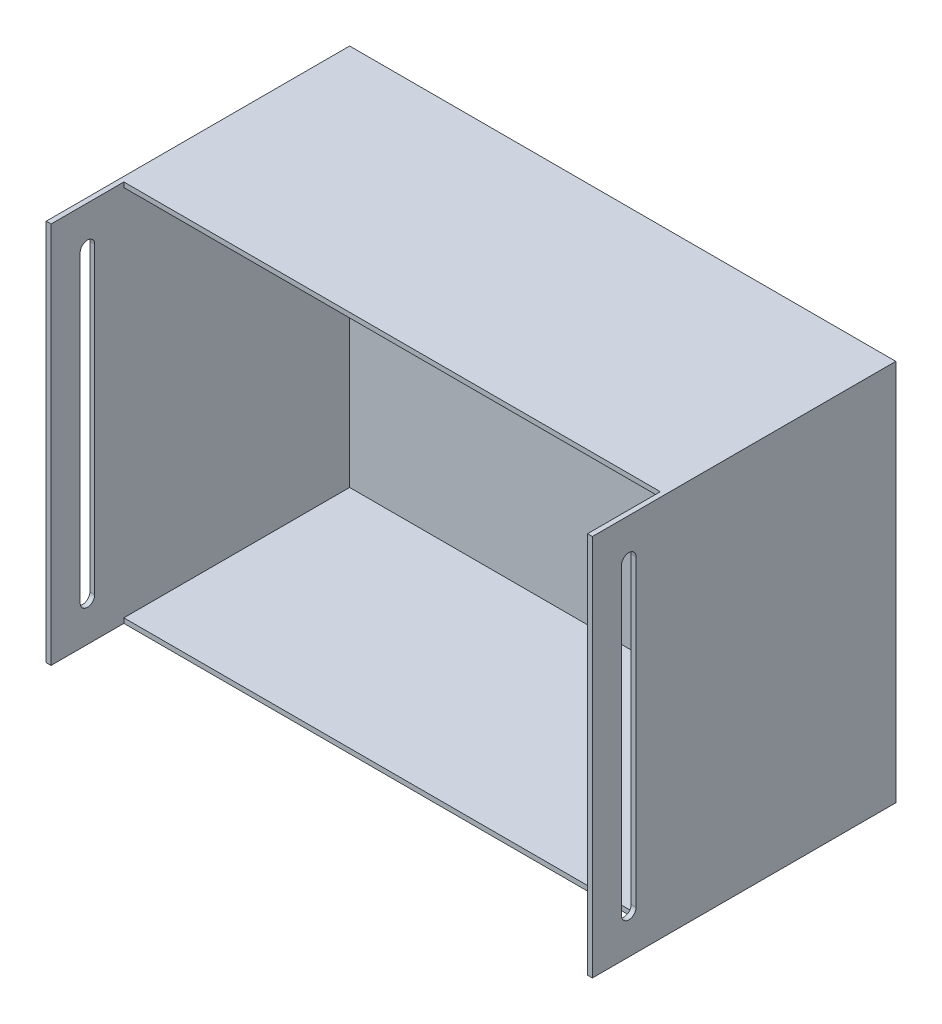
ISO-10303-21;
HEADER;
FILE_DESCRIPTION(('STEP AP214'),'2;1');
FILE_NAME('part.step','',(''),(''),'','','');
FILE_SCHEMA(('AUTOMOTIVE_DESIGN { 1 0 10303 214 1 1 1 1 }'));
ENDSEC;
DATA;
#1=APPLICATION_CONTEXT('core data for automotive mechanical design processes');
#2=APPLICATION_PROTOCOL_DEFINITION('international standard','automotive_design',2000,#1);
#3=PRODUCT_CONTEXT('',#1,'mechanical');
#4=PRODUCT('Part','Part','',(#3));
#5=PRODUCT_RELATED_PRODUCT_CATEGORY('part','',(#4));
#6=PRODUCT_DEFINITION_FORMATION('','',#4);
#7=PRODUCT_DEFINITION_CONTEXT('part definition',#1,'design');
#8=PRODUCT_DEFINITION('design','',#6,#7);
#9=PRODUCT_DEFINITION_SHAPE('','',#8);
#10=(LENGTH_UNIT() NAMED_UNIT(*) SI_UNIT(.MILLI.,.METRE.));
#11=(NAMED_UNIT(*) PLANE_ANGLE_UNIT() SI_UNIT($,.RADIAN.));
#12=(NAMED_UNIT(*) SI_UNIT($,.STERADIAN.) SOLID_ANGLE_UNIT());
#13=UNCERTAINTY_MEASURE_WITH_UNIT(LENGTH_MEASURE(1.E-05),#10,'distance_accuracy_value','');
#14=(GEOMETRIC_REPRESENTATION_CONTEXT(3) GLOBAL_UNCERTAINTY_ASSIGNED_CONTEXT((#13)) GLOBAL_UNIT_ASSIGNED_CONTEXT((#10,
#11,#12)) REPRESENTATION_CONTEXT('',''));
#15=CARTESIAN_POINT('',(0.,0.,0.));
#16=DIRECTION('',(0.,0.,1.));
#17=DIRECTION('',(1.,0.,0.));
#18=AXIS2_PLACEMENT_3D('',#15,#16,#17);
#19=CARTESIAN_POINT('',(0.,0.,0.));
#20=DIRECTION('',(0.,0.,1.));
#21=DIRECTION('',(1.,0.,0.));
#22=AXIS2_PLACEMENT_3D('',#19,#20,#21);
#23=PLANE('',#22);
#24=DIRECTION('',(0.,1.,0.));
#25=VECTOR('',#24,1.);
#26=CARTESIAN_POINT('',(221.,0.,0.));
#27=LINE('',#26,#25);
#28=CARTESIAN_POINT('',(221.,-157.5,0.));
#29=VERTEX_POINT('',#28);
#30=CARTESIAN_POINT('',(221.,157.5,0.));
#31=VERTEX_POINT('',#30);
#32=EDGE_CURVE('E257',#29,#31,#27,.T.);
#33=ORIENTED_EDGE('',*,*,#32,.F.);
#34=DIRECTION('',(1.,0.,0.));
#35=VECTOR('',#34,1.);
#36=CARTESIAN_POINT('',(-225.,-157.5,0.));
#37=LINE('',#36,#35);
#38=CARTESIAN_POINT('',(225.,-157.5,0.));
#39=VERTEX_POINT('',#38);
#40=EDGE_CURVE('E261',#29,#39,#37,.T.);
#41=ORIENTED_EDGE('',*,*,#40,.T.);
#42=DIRECTION('',(0.,1.,0.));
#43=VECTOR('',#42,1.);
#44=CARTESIAN_POINT('',(225.,-157.5,0.));
#45=LINE('',#44,#43);
#46=CARTESIAN_POINT('',(225.,157.5,0.));
#47=VERTEX_POINT('',#46);
#48=EDGE_CURVE('E299',#39,#47,#45,.T.);
#49=ORIENTED_EDGE('',*,*,#48,.T.);
#50=DIRECTION('',(1.,0.,0.));
#51=VECTOR('',#50,1.);
#52=CARTESIAN_POINT('',(-225.,157.5,0.));
#53=LINE('',#52,#51);
#54=EDGE_CURVE('E302',#31,#47,#53,.T.);
#55=ORIENTED_EDGE('',*,*,#54,.F.);
#56=EDGE_LOOP('',(#33,#41,#49,#55));
#57=FACE_BOUND('',#56,.T.);
#58=ADVANCED_FACE('F35',(#57),#23,.T.);
#59=CARTESIAN_POINT('',(-225.,-157.5,-250.));
#60=DIRECTION('',(0.,-1.,0.));
#61=DIRECTION('',(0.,0.,-1.));
#62=AXIS2_PLACEMENT_3D('',#59,#60,#61);
#63=PLANE('',#62);
#64=DIRECTION('',(0.,0.,1.));
#65=VECTOR('',#64,1.);
#66=CARTESIAN_POINT('',(221.,-157.5,-60.));
#67=LINE('',#66,#65);
#68=CARTESIAN_POINT('',(221.,-157.5,-60.));
#69=VERTEX_POINT('',#68);
#70=EDGE_CURVE('E227',#69,#29,#67,.T.);
#71=ORIENTED_EDGE('',*,*,#70,.F.);
#72=DIRECTION('',(1.,0.,0.));
#73=VECTOR('',#72,1.);
#74=CARTESIAN_POINT('',(-221.,-157.5,-60.));
#75=LINE('',#74,#73);
#76=CARTESIAN_POINT('',(-221.,-157.5,-60.));
#77=VERTEX_POINT('',#76);
#78=EDGE_CURVE('E232',#77,#69,#75,.T.);
#79=ORIENTED_EDGE('',*,*,#78,.F.);
#80=DIRECTION('',(0.,0.,-1.));
#81=VECTOR('',#80,1.);
#82=CARTESIAN_POINT('',(-221.,-157.5,-60.));
#83=LINE('',#82,#81);
#84=CARTESIAN_POINT('',(-221.,-157.5,0.));
#85=VERTEX_POINT('',#84);
#86=EDGE_CURVE('E241',#85,#77,#83,.T.);
#87=ORIENTED_EDGE('',*,*,#86,.F.);
#88=CARTESIAN_POINT('',(-225.,-157.5,0.));
#89=VERTEX_POINT('',#88);
#90=EDGE_CURVE('E296',#89,#85,#37,.T.);
#91=ORIENTED_EDGE('',*,*,#90,.F.);
#92=DIRECTION('',(0.,0.,1.));
#93=VECTOR('',#92,1.);
#94=CARTESIAN_POINT('',(-225.,-157.5,-250.));
#95=LINE('',#94,#93);
#96=CARTESIAN_POINT('',(-225.,-157.5,-250.));
#97=VERTEX_POINT('',#96);
#98=EDGE_CURVE('E307',#97,#89,#95,.T.);
#99=ORIENTED_EDGE('',*,*,#98,.F.);
#100=DIRECTION('',(1.,0.,0.));
#101=VECTOR('',#100,1.);
#102=CARTESIAN_POINT('',(-225.,-157.5,-250.));
#103=LINE('',#102,#101);
#104=CARTESIAN_POINT('',(225.,-157.5,-250.));
#105=VERTEX_POINT('',#104);
#106=EDGE_CURVE('E284',#97,#105,#103,.T.);
#107=ORIENTED_EDGE('',*,*,#106,.T.);
#108=DIRECTION('',(0.,0.,1.));
#109=VECTOR('',#108,1.);
#110=CARTESIAN_POINT('',(225.,-157.5,-250.));
#111=LINE('',#110,#109);
#112=EDGE_CURVE('E295',#105,#39,#111,.T.);
#113=ORIENTED_EDGE('',*,*,#112,.T.);
#114=ORIENTED_EDGE('',*,*,#40,.F.);
#115=EDGE_LOOP('',(#71,#79,#87,#91,#99,#107,#113,#114));
#116=FACE_BOUND('',#115,.T.);
#117=ADVANCED_FACE('F37',(#116),#63,.T.);
#118=CARTESIAN_POINT('',(-225.,-157.5,-250.));
#119=DIRECTION('',(1.,0.,0.));
#120=DIRECTION('',(0.,0.,-1.));
#121=AXIS2_PLACEMENT_3D('',#118,#119,#120);
#122=PLANE('',#121);
#123=DIRECTION('',(0.,1.,0.));
#124=VECTOR('',#123,1.);
#125=CARTESIAN_POINT('',(-225.,125.,-36.0000000000001));
#126=LINE('',#125,#124);
#127=CARTESIAN_POINT('',(-225.,-125.,-36.0000000000001));
#128=VERTEX_POINT('',#127);
#129=CARTESIAN_POINT('',(-225.,125.,-36.0000000000001));
#130=VERTEX_POINT('',#129);
#131=EDGE_CURVE('E197',#128,#130,#126,.T.);
#132=ORIENTED_EDGE('',*,*,#131,.T.);
#133=CARTESIAN_POINT('',(-225.,125.,-30.));
#134=DIRECTION('',(1.,0.,0.));
#135=DIRECTION('',(0.,0.,-1.));
#136=AXIS2_PLACEMENT_3D('',#133,#134,#135);
#137=CIRCLE('',#136,6.00000000000003);
#138=CARTESIAN_POINT('',(-225.,125.,-24.));
#139=VERTEX_POINT('',#138);
#140=EDGE_CURVE('E179',#130,#139,#137,.T.);
#141=ORIENTED_EDGE('',*,*,#140,.T.);
#142=DIRECTION('',(0.,-1.,0.));
#143=VECTOR('',#142,1.);
#144=CARTESIAN_POINT('',(-225.,125.,-24.));
#145=LINE('',#144,#143);
#146=CARTESIAN_POINT('',(-225.,-125.,-24.));
#147=VERTEX_POINT('',#146);
#148=EDGE_CURVE('E189',#139,#147,#145,.T.);
#149=ORIENTED_EDGE('',*,*,#148,.T.);
#150=CARTESIAN_POINT('',(-225.,-125.,-30.));
#151=DIRECTION('',(1.,0.,0.));
#152=DIRECTION('',(0.,0.,-1.));
#153=AXIS2_PLACEMENT_3D('',#150,#151,#152);
#154=CIRCLE('',#153,6.00000000000003);
#155=EDGE_CURVE('E50',#147,#128,#154,.T.);
#156=ORIENTED_EDGE('',*,*,#155,.T.);
#157=EDGE_LOOP('',(#132,#141,#149,#156));
#158=FACE_BOUND('',#157,.T.);
#159=DIRECTION('',(0.,1.,0.));
#160=VECTOR('',#159,1.);
#161=CARTESIAN_POINT('',(-225.,-157.5,0.));
#162=LINE('',#161,#160);
#163=CARTESIAN_POINT('',(-225.,157.5,0.));
#164=VERTEX_POINT('',#163);
#165=EDGE_CURVE('E288',#89,#164,#162,.T.);
#166=ORIENTED_EDGE('',*,*,#165,.T.);
#167=DIRECTION('',(0.,0.,1.));
#168=VECTOR('',#167,1.);
#169=CARTESIAN_POINT('',(-225.,157.5,-250.));
#170=LINE('',#169,#168);
#171=CARTESIAN_POINT('',(-225.,157.5,-250.));
#172=VERTEX_POINT('',#171);
#173=EDGE_CURVE('E310',#172,#164,#170,.T.);
#174=ORIENTED_EDGE('',*,*,#173,.F.);
#175=DIRECTION('',(0.,1.,0.));
#176=VECTOR('',#175,1.);
#177=CARTESIAN_POINT('',(-225.,-157.5,-250.));
#178=LINE('',#177,#176);
#179=EDGE_CURVE('E293',#97,#172,#178,.T.);
#180=ORIENTED_EDGE('',*,*,#179,.F.);
#181=ORIENTED_EDGE('',*,*,#98,.T.);
#182=EDGE_LOOP('',(#166,#174,#180,#181));
#183=FACE_BOUND('',#182,.T.);
#184=ADVANCED_FACE('F194',(#158,#183),#122,.F.);
#185=CARTESIAN_POINT('',(-225.,157.5,-250.));
#186=DIRECTION('',(0.,-1.,0.));
#187=DIRECTION('',(0.,0.,-1.));
#188=AXIS2_PLACEMENT_3D('',#185,#186,#187);
#189=PLANE('',#188);
#190=DIRECTION('',(1.,0.,0.));
#191=VECTOR('',#190,1.);
#192=CARTESIAN_POINT('',(-221.,157.5,-60.));
#193=LINE('',#192,#191);
#194=CARTESIAN_POINT('',(-221.,157.5,-60.));
#195=VERTEX_POINT('',#194);
#196=CARTESIAN_POINT('',(221.,157.5,-60.));
#197=VERTEX_POINT('',#196);
#198=EDGE_CURVE('E235',#195,#197,#193,.T.);
#199=ORIENTED_EDGE('',*,*,#198,.T.);
#200=DIRECTION('',(0.,0.,1.));
#201=VECTOR('',#200,1.);
#202=CARTESIAN_POINT('',(221.,157.5,-60.));
#203=LINE('',#202,#201);
#204=EDGE_CURVE('E228',#197,#31,#203,.T.);
#205=ORIENTED_EDGE('',*,*,#204,.T.);
#206=ORIENTED_EDGE('',*,*,#54,.T.);
#207=DIRECTION('',(0.,0.,1.));
#208=VECTOR('',#207,1.);
#209=CARTESIAN_POINT('',(225.,157.5,-250.));
#210=LINE('',#209,#208);
#211=CARTESIAN_POINT('',(225.,157.5,-250.));
#212=VERTEX_POINT('',#211);
#213=EDGE_CURVE('E313',#212,#47,#210,.T.);
#214=ORIENTED_EDGE('',*,*,#213,.F.);
#215=DIRECTION('',(1.,0.,0.));
#216=VECTOR('',#215,1.);
#217=CARTESIAN_POINT('',(-225.,157.5,-250.));
#218=LINE('',#217,#216);
#219=EDGE_CURVE('E291',#172,#212,#218,.T.);
#220=ORIENTED_EDGE('',*,*,#219,.F.);
#221=ORIENTED_EDGE('',*,*,#173,.T.);
#222=CARTESIAN_POINT('',(-221.,157.5,0.));
#223=VERTEX_POINT('',#222);
#224=EDGE_CURVE('E303',#164,#223,#53,.T.);
#225=ORIENTED_EDGE('',*,*,#224,.T.);
#226=DIRECTION('',(0.,0.,-1.));
#227=VECTOR('',#226,1.);
#228=CARTESIAN_POINT('',(-221.,157.5,-60.));
#229=LINE('',#228,#227);
#230=EDGE_CURVE('E231',#223,#195,#229,.T.);
#231=ORIENTED_EDGE('',*,*,#230,.T.);
#232=EDGE_LOOP('',(#199,#205,#206,#214,#220,#221,#225,#231));
#233=FACE_BOUND('',#232,.T.);
#234=ADVANCED_FACE('F382',(#233),#189,.F.);
#235=CARTESIAN_POINT('',(225.,-157.5,-250.));
#236=DIRECTION('',(1.,0.,0.));
#237=DIRECTION('',(0.,0.,-1.));
#238=AXIS2_PLACEMENT_3D('',#235,#236,#237);
#239=PLANE('',#238);
#240=CARTESIAN_POINT('',(225.,125.,-30.));
#241=DIRECTION('',(1.,0.,0.));
#242=DIRECTION('',(0.,0.,-1.));
#243=AXIS2_PLACEMENT_3D('',#240,#241,#242);
#244=CIRCLE('',#243,6.00000000000003);
#245=CARTESIAN_POINT('',(225.,125.,-36.0000000000001));
#246=VERTEX_POINT('',#245);
#247=CARTESIAN_POINT('',(225.,125.,-24.));
#248=VERTEX_POINT('',#247);
#249=EDGE_CURVE('E58',#246,#248,#244,.T.);
#250=ORIENTED_EDGE('',*,*,#249,.F.);
#251=DIRECTION('',(0.,1.,0.));
#252=VECTOR('',#251,1.);
#253=CARTESIAN_POINT('',(225.,125.,-36.0000000000001));
#254=LINE('',#253,#252);
#255=CARTESIAN_POINT('',(225.,-125.,-36.0000000000001));
#256=VERTEX_POINT('',#255);
#257=EDGE_CURVE('E198',#256,#246,#254,.T.);
#258=ORIENTED_EDGE('',*,*,#257,.F.);
#259=CARTESIAN_POINT('',(225.,-125.,-30.));
#260=DIRECTION('',(1.,0.,0.));
#261=DIRECTION('',(0.,0.,-1.));
#262=AXIS2_PLACEMENT_3D('',#259,#260,#261);
#263=CIRCLE('',#262,6.00000000000003);
#264=CARTESIAN_POINT('',(225.,-125.,-24.));
#265=VERTEX_POINT('',#264);
#266=EDGE_CURVE('E201',#265,#256,#263,.T.);
#267=ORIENTED_EDGE('',*,*,#266,.F.);
#268=DIRECTION('',(0.,-1.,0.));
#269=VECTOR('',#268,1.);
#270=CARTESIAN_POINT('',(225.,125.,-24.));
#271=LINE('',#270,#269);
#272=EDGE_CURVE('E207',#248,#265,#271,.T.);
#273=ORIENTED_EDGE('',*,*,#272,.F.);
#274=EDGE_LOOP('',(#250,#258,#267,#273));
#275=FACE_BOUND('',#274,.T.);
#276=ORIENTED_EDGE('',*,*,#48,.F.);
#277=ORIENTED_EDGE('',*,*,#112,.F.);
#278=DIRECTION('',(0.,1.,0.));
#279=VECTOR('',#278,1.);
#280=CARTESIAN_POINT('',(225.,-157.5,-250.));
#281=LINE('',#280,#279);
#282=EDGE_CURVE('E287',#105,#212,#281,.T.);
#283=ORIENTED_EDGE('',*,*,#282,.T.);
#284=ORIENTED_EDGE('',*,*,#213,.T.);
#285=EDGE_LOOP('',(#276,#277,#283,#284));
#286=FACE_BOUND('',#285,.T.);
#287=ADVANCED_FACE('F337',(#275,#286),#239,.T.);
#288=CARTESIAN_POINT('',(0.,0.,-250.));
#289=DIRECTION('',(0.,0.,1.));
#290=DIRECTION('',(1.,0.,0.));
#291=AXIS2_PLACEMENT_3D('',#288,#289,#290);
#292=PLANE('',#291);
#293=ORIENTED_EDGE('',*,*,#106,.F.);
#294=ORIENTED_EDGE('',*,*,#179,.T.);
#295=ORIENTED_EDGE('',*,*,#219,.T.);
#296=ORIENTED_EDGE('',*,*,#282,.F.);
#297=EDGE_LOOP('',(#293,#294,#295,#296));
#298=FACE_BOUND('',#297,.T.);
#299=ADVANCED_FACE('F364',(#298),#292,.F.);
#300=DIRECTION('',(0.,1.,0.));
#301=VECTOR('',#300,1.);
#302=CARTESIAN_POINT('',(-221.,0.,0.));
#303=LINE('',#302,#301);
#304=EDGE_CURVE('E267',#85,#223,#303,.T.);
#305=ORIENTED_EDGE('',*,*,#304,.T.);
#306=ORIENTED_EDGE('',*,*,#224,.F.);
#307=ORIENTED_EDGE('',*,*,#165,.F.);
#308=ORIENTED_EDGE('',*,*,#90,.T.);
#309=EDGE_LOOP('',(#305,#306,#307,#308));
#310=FACE_BOUND('',#309,.T.);
#311=ADVANCED_FACE('F355',(#310),#23,.T.);
#312=CARTESIAN_POINT('',(-225.,-153.5,-250.));
#313=DIRECTION('',(0.,-1.,0.));
#314=DIRECTION('',(0.,0.,-1.));
#315=AXIS2_PLACEMENT_3D('',#312,#313,#314);
#316=PLANE('',#315);
#317=DIRECTION('',(0.,0.,1.));
#318=VECTOR('',#317,1.);
#319=CARTESIAN_POINT('',(-221.,-153.5,-250.));
#320=LINE('',#319,#318);
#321=CARTESIAN_POINT('',(-221.,-153.5,-246.));
#322=VERTEX_POINT('',#321);
#323=CARTESIAN_POINT('',(-221.,-153.5,-60.));
#324=VERTEX_POINT('',#323);
#325=EDGE_CURVE('E258',#322,#324,#320,.T.);
#326=ORIENTED_EDGE('',*,*,#325,.T.);
#327=DIRECTION('',(1.,0.,0.));
#328=VECTOR('',#327,1.);
#329=CARTESIAN_POINT('',(-225.,-153.5,-60.));
#330=LINE('',#329,#328);
#331=CARTESIAN_POINT('',(221.,-153.5,-60.));
#332=VERTEX_POINT('',#331);
#333=EDGE_CURVE('E254',#324,#332,#330,.T.);
#334=ORIENTED_EDGE('',*,*,#333,.T.);
#335=DIRECTION('',(0.,0.,1.));
#336=VECTOR('',#335,1.);
#337=CARTESIAN_POINT('',(221.,-153.5,-250.));
#338=LINE('',#337,#336);
#339=CARTESIAN_POINT('',(221.,-153.5,-246.));
#340=VERTEX_POINT('',#339);
#341=EDGE_CURVE('E268',#340,#332,#338,.T.);
#342=ORIENTED_EDGE('',*,*,#341,.F.);
#343=DIRECTION('',(1.,0.,0.));
#344=VECTOR('',#343,1.);
#345=CARTESIAN_POINT('',(0.,-153.5,-246.));
#346=LINE('',#345,#344);
#347=EDGE_CURVE('E263',#322,#340,#346,.T.);
#348=ORIENTED_EDGE('',*,*,#347,.F.);
#349=EDGE_LOOP('',(#326,#334,#342,#348));
#350=FACE_BOUND('',#349,.T.);
#351=ADVANCED_FACE('F363',(#350),#316,.F.);
#352=CARTESIAN_POINT('',(-221.,-157.5,-250.));
#353=DIRECTION('',(1.,0.,0.));
#354=DIRECTION('',(0.,0.,-1.));
#355=AXIS2_PLACEMENT_3D('',#352,#353,#354);
#356=PLANE('',#355);
#357=CARTESIAN_POINT('',(-221.,125.,-30.));
#358=DIRECTION('',(1.,0.,0.));
#359=DIRECTION('',(0.,0.,-1.));
#360=AXIS2_PLACEMENT_3D('',#357,#358,#359);
#361=CIRCLE('',#360,6.00000000000003);
#362=CARTESIAN_POINT('',(-221.,125.,-36.0000000000001));
#363=VERTEX_POINT('',#362);
#364=CARTESIAN_POINT('',(-221.,125.,-24.));
#365=VERTEX_POINT('',#364);
#366=EDGE_CURVE('E182',#363,#365,#361,.T.);
#367=ORIENTED_EDGE('',*,*,#366,.F.);
#368=DIRECTION('',(0.,1.,0.));
#369=VECTOR('',#368,1.);
#370=CARTESIAN_POINT('',(-221.,-157.5,-36.0000000000001));
#371=LINE('',#370,#369);
#372=CARTESIAN_POINT('',(-221.,-125.,-36.0000000000001));
#373=VERTEX_POINT('',#372);
#374=EDGE_CURVE('E224',#373,#363,#371,.T.);
#375=ORIENTED_EDGE('',*,*,#374,.F.);
#376=CARTESIAN_POINT('',(-221.,-125.,-30.));
#377=DIRECTION('',(1.,0.,0.));
#378=DIRECTION('',(0.,0.,-1.));
#379=AXIS2_PLACEMENT_3D('',#376,#377,#378);
#380=CIRCLE('',#379,6.00000000000003);
#381=CARTESIAN_POINT('',(-221.,-125.,-24.));
#382=VERTEX_POINT('',#381);
#383=EDGE_CURVE('E222',#382,#373,#380,.T.);
#384=ORIENTED_EDGE('',*,*,#383,.F.);
#385=DIRECTION('',(0.,-1.,0.));
#386=VECTOR('',#385,1.);
#387=CARTESIAN_POINT('',(-221.,-157.5,-24.));
#388=LINE('',#387,#386);
#389=EDGE_CURVE('E214',#365,#382,#388,.T.);
#390=ORIENTED_EDGE('',*,*,#389,.F.);
#391=EDGE_LOOP('',(#367,#375,#384,#390));
#392=FACE_BOUND('',#391,.T.);
#393=DIRECTION('',(0.,0.,1.));
#394=VECTOR('',#393,1.);
#395=CARTESIAN_POINT('',(-221.,153.5,-250.));
#396=LINE('',#395,#394);
#397=CARTESIAN_POINT('',(-221.,153.5,-246.));
#398=VERTEX_POINT('',#397);
#399=CARTESIAN_POINT('',(-221.,153.5,-60.));
#400=VERTEX_POINT('',#399);
#401=EDGE_CURVE('E262',#398,#400,#396,.T.);
#402=ORIENTED_EDGE('',*,*,#401,.T.);
#403=DIRECTION('',(0.,-1.,0.));
#404=VECTOR('',#403,1.);
#405=CARTESIAN_POINT('',(-221.,157.5,-60.));
#406=LINE('',#405,#404);
#407=EDGE_CURVE('E251',#195,#400,#406,.T.);
#408=ORIENTED_EDGE('',*,*,#407,.F.);
#409=ORIENTED_EDGE('',*,*,#230,.F.);
#410=ORIENTED_EDGE('',*,*,#304,.F.);
#411=ORIENTED_EDGE('',*,*,#86,.T.);
#412=EDGE_CURVE('E238',#324,#77,#406,.T.);
#413=ORIENTED_EDGE('',*,*,#412,.F.);
#414=ORIENTED_EDGE('',*,*,#325,.F.);
#415=DIRECTION('',(0.,1.,0.));
#416=VECTOR('',#415,1.);
#417=CARTESIAN_POINT('',(-221.,0.,-246.));
#418=LINE('',#417,#416);
#419=EDGE_CURVE('E272',#322,#398,#418,.T.);
#420=ORIENTED_EDGE('',*,*,#419,.T.);
#421=EDGE_LOOP('',(#402,#408,#409,#410,#411,#413,#414,#420));
#422=FACE_BOUND('',#421,.T.);
#423=ADVANCED_FACE('F370',(#392,#422),#356,.T.);
#424=CARTESIAN_POINT('',(-225.,153.5,-250.));
#425=DIRECTION('',(0.,-1.,0.));
#426=DIRECTION('',(0.,0.,-1.));
#427=AXIS2_PLACEMENT_3D('',#424,#425,#426);
#428=PLANE('',#427);
#429=DIRECTION('',(1.,0.,0.));
#430=VECTOR('',#429,1.);
#431=CARTESIAN_POINT('',(-225.,153.5,-60.));
#432=LINE('',#431,#430);
#433=CARTESIAN_POINT('',(221.,153.5,-60.));
#434=VERTEX_POINT('',#433);
#435=EDGE_CURVE('E249',#400,#434,#432,.T.);
#436=ORIENTED_EDGE('',*,*,#435,.F.);
#437=ORIENTED_EDGE('',*,*,#401,.F.);
#438=DIRECTION('',(1.,0.,0.));
#439=VECTOR('',#438,1.);
#440=CARTESIAN_POINT('',(0.,153.5,-246.));
#441=LINE('',#440,#439);
#442=CARTESIAN_POINT('',(221.,153.5,-246.));
#443=VERTEX_POINT('',#442);
#444=EDGE_CURVE('E276',#398,#443,#441,.T.);
#445=ORIENTED_EDGE('',*,*,#444,.T.);
#446=DIRECTION('',(0.,0.,1.));
#447=VECTOR('',#446,1.);
#448=CARTESIAN_POINT('',(221.,153.5,-250.));
#449=LINE('',#448,#447);
#450=EDGE_CURVE('E271',#443,#434,#449,.T.);
#451=ORIENTED_EDGE('',*,*,#450,.T.);
#452=EDGE_LOOP('',(#436,#437,#445,#451));
#453=FACE_BOUND('',#452,.T.);
#454=ADVANCED_FACE('F402',(#453),#428,.T.);
#455=CARTESIAN_POINT('',(221.,-157.5,-250.));
#456=DIRECTION('',(1.,0.,0.));
#457=DIRECTION('',(0.,0.,-1.));
#458=AXIS2_PLACEMENT_3D('',#455,#456,#457);
#459=PLANE('',#458);
#460=DIRECTION('',(0.,1.,0.));
#461=VECTOR('',#460,1.);
#462=CARTESIAN_POINT('',(221.,-157.5,-36.0000000000001));
#463=LINE('',#462,#461);
#464=CARTESIAN_POINT('',(221.,-125.,-36.0000000000001));
#465=VERTEX_POINT('',#464);
#466=CARTESIAN_POINT('',(221.,125.,-36.0000000000001));
#467=VERTEX_POINT('',#466);
#468=EDGE_CURVE('E43',#465,#467,#463,.T.);
#469=ORIENTED_EDGE('',*,*,#468,.T.);
#470=CARTESIAN_POINT('',(221.,125.,-30.));
#471=DIRECTION('',(1.,0.,0.));
#472=DIRECTION('',(0.,0.,-1.));
#473=AXIS2_PLACEMENT_3D('',#470,#471,#472);
#474=CIRCLE('',#473,6.00000000000003);
#475=CARTESIAN_POINT('',(221.,125.,-24.));
#476=VERTEX_POINT('',#475);
#477=EDGE_CURVE('E11',#467,#476,#474,.T.);
#478=ORIENTED_EDGE('',*,*,#477,.T.);
#479=DIRECTION('',(0.,-1.,0.));
#480=VECTOR('',#479,1.);
#481=CARTESIAN_POINT('',(221.,-157.5,-24.));
#482=LINE('',#481,#480);
#483=CARTESIAN_POINT('',(221.,-125.,-24.));
#484=VERTEX_POINT('',#483);
#485=EDGE_CURVE('E309',#476,#484,#482,.T.);
#486=ORIENTED_EDGE('',*,*,#485,.T.);
#487=CARTESIAN_POINT('',(221.,-125.,-30.));
#488=DIRECTION('',(1.,0.,0.));
#489=DIRECTION('',(0.,0.,-1.));
#490=AXIS2_PLACEMENT_3D('',#487,#488,#489);
#491=CIRCLE('',#490,6.00000000000003);
#492=EDGE_CURVE('E320',#484,#465,#491,.T.);
#493=ORIENTED_EDGE('',*,*,#492,.T.);
#494=EDGE_LOOP('',(#469,#478,#486,#493));
#495=FACE_BOUND('',#494,.T.);
#496=ORIENTED_EDGE('',*,*,#341,.T.);
#497=DIRECTION('',(0.,-1.,0.));
#498=VECTOR('',#497,1.);
#499=CARTESIAN_POINT('',(221.,157.5,-60.));
#500=LINE('',#499,#498);
#501=EDGE_CURVE('E250',#332,#69,#500,.T.);
#502=ORIENTED_EDGE('',*,*,#501,.T.);
#503=ORIENTED_EDGE('',*,*,#70,.T.);
#504=ORIENTED_EDGE('',*,*,#32,.T.);
#505=ORIENTED_EDGE('',*,*,#204,.F.);
#506=EDGE_CURVE('E246',#197,#434,#500,.T.);
#507=ORIENTED_EDGE('',*,*,#506,.T.);
#508=ORIENTED_EDGE('',*,*,#450,.F.);
#509=DIRECTION('',(0.,1.,0.));
#510=VECTOR('',#509,1.);
#511=CARTESIAN_POINT('',(221.,0.,-246.));
#512=LINE('',#511,#510);
#513=EDGE_CURVE('E266',#340,#443,#512,.T.);
#514=ORIENTED_EDGE('',*,*,#513,.F.);
#515=EDGE_LOOP('',(#496,#502,#503,#504,#505,#507,#508,#514));
#516=FACE_BOUND('',#515,.T.);
#517=ADVANCED_FACE('F324',(#495,#516),#459,.F.);
#518=CARTESIAN_POINT('',(0.,0.,-246.));
#519=DIRECTION('',(0.,0.,1.));
#520=DIRECTION('',(1.,0.,0.));
#521=AXIS2_PLACEMENT_3D('',#518,#519,#520);
#522=PLANE('',#521);
#523=ORIENTED_EDGE('',*,*,#347,.T.);
#524=ORIENTED_EDGE('',*,*,#513,.T.);
#525=ORIENTED_EDGE('',*,*,#444,.F.);
#526=ORIENTED_EDGE('',*,*,#419,.F.);
#527=EDGE_LOOP('',(#523,#524,#525,#526));
#528=FACE_BOUND('',#527,.T.);
#529=ADVANCED_FACE('F397',(#528),#522,.T.);
#530=CARTESIAN_POINT('',(-221.,157.5,-60.));
#531=DIRECTION('',(0.,0.,-1.));
#532=DIRECTION('',(-1.,0.,0.));
#533=AXIS2_PLACEMENT_3D('',#530,#531,#532);
#534=PLANE('',#533);
#535=ORIENTED_EDGE('',*,*,#435,.T.);
#536=ORIENTED_EDGE('',*,*,#506,.F.);
#537=ORIENTED_EDGE('',*,*,#198,.F.);
#538=ORIENTED_EDGE('',*,*,#407,.T.);
#539=EDGE_LOOP('',(#535,#536,#537,#538));
#540=FACE_BOUND('',#539,.T.);
#541=ADVANCED_FACE('F405',(#540),#534,.F.);
#542=ORIENTED_EDGE('',*,*,#412,.T.);
#543=ORIENTED_EDGE('',*,*,#78,.T.);
#544=ORIENTED_EDGE('',*,*,#501,.F.);
#545=ORIENTED_EDGE('',*,*,#333,.F.);
#546=EDGE_LOOP('',(#542,#543,#544,#545));
#547=FACE_BOUND('',#546,.T.);
#548=ADVANCED_FACE('F393',(#547),#534,.F.);
#549=CARTESIAN_POINT('',(-225.,125.,-24.));
#550=DIRECTION('',(0.,0.,1.));
#551=DIRECTION('',(1.,0.,0.));
#552=AXIS2_PLACEMENT_3D('',#549,#550,#551);
#553=PLANE('',#552);
#554=DIRECTION('',(1.,0.,0.));
#555=VECTOR('',#554,1.);
#556=CARTESIAN_POINT('',(-225.,125.,-24.));
#557=LINE('',#556,#555);
#558=EDGE_CURVE('E186',#476,#248,#557,.T.);
#559=ORIENTED_EDGE('',*,*,#558,.T.);
#560=ORIENTED_EDGE('',*,*,#272,.T.);
#561=DIRECTION('',(1.,0.,0.));
#562=VECTOR('',#561,1.);
#563=CARTESIAN_POINT('',(-225.,-125.,-24.));
#564=LINE('',#563,#562);
#565=EDGE_CURVE('E185',#484,#265,#564,.T.);
#566=ORIENTED_EDGE('',*,*,#565,.F.);
#567=ORIENTED_EDGE('',*,*,#485,.F.);
#568=EDGE_LOOP('',(#559,#560,#566,#567));
#569=FACE_BOUND('',#568,.T.);
#570=ADVANCED_FACE('F340',(#569),#553,.F.);
#571=CARTESIAN_POINT('',(-225.,-125.,-30.));
#572=DIRECTION('',(1.,0.,0.));
#573=DIRECTION('',(0.,0.,-1.));
#574=AXIS2_PLACEMENT_3D('',#571,#572,#573);
#575=CYLINDRICAL_SURFACE('',#574,6.00000000000003);
#576=ORIENTED_EDGE('',*,*,#565,.T.);
#577=ORIENTED_EDGE('',*,*,#266,.T.);
#578=DIRECTION('',(1.,0.,0.));
#579=VECTOR('',#578,1.);
#580=CARTESIAN_POINT('',(-225.,-125.,-36.0000000000001));
#581=LINE('',#580,#579);
#582=EDGE_CURVE('E219',#465,#256,#581,.T.);
#583=ORIENTED_EDGE('',*,*,#582,.F.);
#584=ORIENTED_EDGE('',*,*,#492,.F.);
#585=EDGE_LOOP('',(#576,#577,#583,#584));
#586=FACE_BOUND('',#585,.T.);
#587=ADVANCED_FACE('F332',(#586),#575,.F.);
#588=CARTESIAN_POINT('',(-225.,125.,-36.0000000000001));
#589=DIRECTION('',(0.,0.,-1.));
#590=DIRECTION('',(-1.,0.,0.));
#591=AXIS2_PLACEMENT_3D('',#588,#589,#590);
#592=PLANE('',#591);
#593=ORIENTED_EDGE('',*,*,#582,.T.);
#594=ORIENTED_EDGE('',*,*,#257,.T.);
#595=DIRECTION('',(1.,0.,0.));
#596=VECTOR('',#595,1.);
#597=CARTESIAN_POINT('',(-225.,125.,-36.0000000000001));
#598=LINE('',#597,#596);
#599=EDGE_CURVE('E215',#467,#246,#598,.T.);
#600=ORIENTED_EDGE('',*,*,#599,.F.);
#601=ORIENTED_EDGE('',*,*,#468,.F.);
#602=EDGE_LOOP('',(#593,#594,#600,#601));
#603=FACE_BOUND('',#602,.T.);
#604=ADVANCED_FACE('F330',(#603),#592,.F.);
#605=CARTESIAN_POINT('',(-225.,125.,-30.));
#606=DIRECTION('',(1.,0.,0.));
#607=DIRECTION('',(0.,0.,-1.));
#608=AXIS2_PLACEMENT_3D('',#605,#606,#607);
#609=CYLINDRICAL_SURFACE('',#608,6.00000000000003);
#610=ORIENTED_EDGE('',*,*,#599,.T.);
#611=ORIENTED_EDGE('',*,*,#249,.T.);
#612=ORIENTED_EDGE('',*,*,#558,.F.);
#613=ORIENTED_EDGE('',*,*,#477,.F.);
#614=EDGE_LOOP('',(#610,#611,#612,#613));
#615=FACE_BOUND('',#614,.T.);
#616=ADVANCED_FACE('F341',(#615),#609,.F.);
#617=ORIENTED_EDGE('',*,*,#366,.T.);
#618=EDGE_CURVE('E174',#139,#365,#557,.T.);
#619=ORIENTED_EDGE('',*,*,#618,.F.);
#620=ORIENTED_EDGE('',*,*,#140,.F.);
#621=EDGE_CURVE('E212',#130,#363,#598,.T.);
#622=ORIENTED_EDGE('',*,*,#621,.T.);
#623=EDGE_LOOP('',(#617,#619,#620,#622));
#624=FACE_BOUND('',#623,.T.);
#625=ADVANCED_FACE('F176',(#624),#609,.F.);
#626=ORIENTED_EDGE('',*,*,#374,.T.);
#627=ORIENTED_EDGE('',*,*,#621,.F.);
#628=ORIENTED_EDGE('',*,*,#131,.F.);
#629=EDGE_CURVE('E216',#128,#373,#581,.T.);
#630=ORIENTED_EDGE('',*,*,#629,.T.);
#631=EDGE_LOOP('',(#626,#627,#628,#630));
#632=FACE_BOUND('',#631,.T.);
#633=ADVANCED_FACE('F348',(#632),#592,.F.);
#634=ORIENTED_EDGE('',*,*,#383,.T.);
#635=ORIENTED_EDGE('',*,*,#629,.F.);
#636=ORIENTED_EDGE('',*,*,#155,.F.);
#637=EDGE_CURVE('E191',#147,#382,#564,.T.);
#638=ORIENTED_EDGE('',*,*,#637,.T.);
#639=EDGE_LOOP('',(#634,#635,#636,#638));
#640=FACE_BOUND('',#639,.T.);
#641=ADVANCED_FACE('F481',(#640),#575,.F.);
#642=ORIENTED_EDGE('',*,*,#389,.T.);
#643=ORIENTED_EDGE('',*,*,#637,.F.);
#644=ORIENTED_EDGE('',*,*,#148,.F.);
#645=ORIENTED_EDGE('',*,*,#618,.T.);
#646=EDGE_LOOP('',(#642,#643,#644,#645));
#647=FACE_BOUND('',#646,.T.);
#648=ADVANCED_FACE('F190',(#647),#553,.F.);
#649=CLOSED_SHELL('',(#58,#117,#184,#234,#287,#299,#311,#351,#423,#454,#517,#529,#541,#548,#570,
#587,#604,#616,#625,#633,#641,#648));
#650=MANIFOLD_SOLID_BREP('B2',#649);
#651=ADVANCED_BREP_SHAPE_REPRESENTATION('',(#18,#650),#14);
#652=SHAPE_DEFINITION_REPRESENTATION(#9,#651);
ENDSEC;
END-ISO-10303-21;
